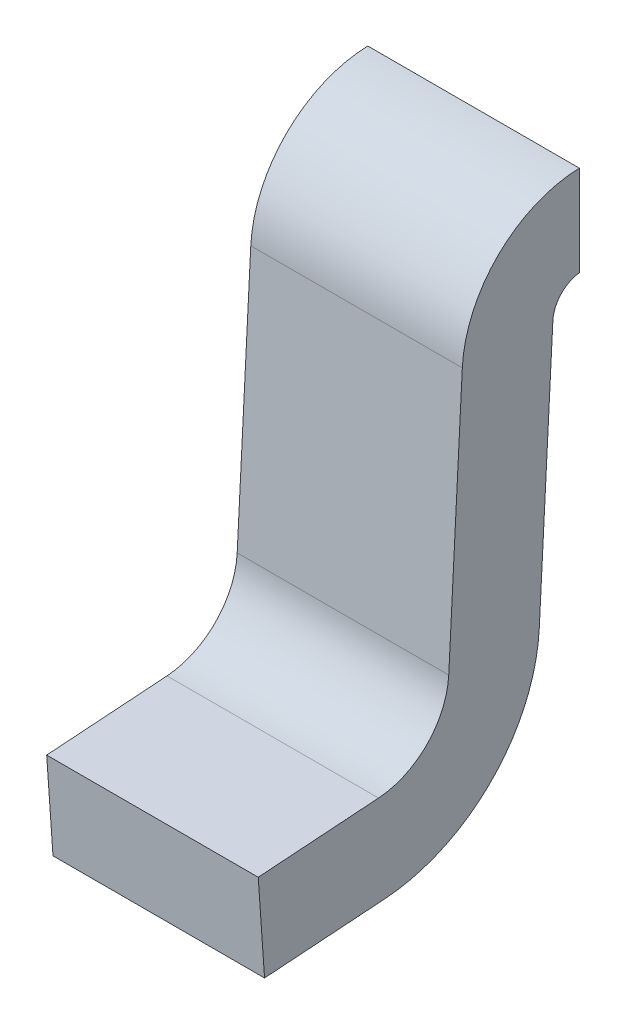
ISO-10303-21;
HEADER;
FILE_DESCRIPTION(('STEP AP214'),'2;1');
FILE_NAME('part.step','',(''),(''),'','','');
FILE_SCHEMA(('AUTOMOTIVE_DESIGN { 1 0 10303 214 1 1 1 1 }'));
ENDSEC;
DATA;
#1=APPLICATION_CONTEXT('core data for automotive mechanical design processes');
#2=APPLICATION_PROTOCOL_DEFINITION('international standard','automotive_design',2000,#1);
#3=PRODUCT_CONTEXT('',#1,'mechanical');
#4=PRODUCT('Part','Part','',(#3));
#5=PRODUCT_RELATED_PRODUCT_CATEGORY('part','',(#4));
#6=PRODUCT_DEFINITION_FORMATION('','',#4);
#7=PRODUCT_DEFINITION_CONTEXT('part definition',#1,'design');
#8=PRODUCT_DEFINITION('design','',#6,#7);
#9=PRODUCT_DEFINITION_SHAPE('','',#8);
#10=(LENGTH_UNIT() NAMED_UNIT(*) SI_UNIT(.MILLI.,.METRE.));
#11=(NAMED_UNIT(*) PLANE_ANGLE_UNIT() SI_UNIT($,.RADIAN.));
#12=(NAMED_UNIT(*) SI_UNIT($,.STERADIAN.) SOLID_ANGLE_UNIT());
#13=UNCERTAINTY_MEASURE_WITH_UNIT(LENGTH_MEASURE(1.E-05),#10,'distance_accuracy_value','');
#14=(GEOMETRIC_REPRESENTATION_CONTEXT(3) GLOBAL_UNCERTAINTY_ASSIGNED_CONTEXT((#13)) GLOBAL_UNIT_ASSIGNED_CONTEXT((#10,
#11,#12)) REPRESENTATION_CONTEXT('',''));
#15=CARTESIAN_POINT('',(0.,0.,0.));
#16=DIRECTION('',(0.,0.,1.));
#17=DIRECTION('',(1.,0.,0.));
#18=AXIS2_PLACEMENT_3D('',#15,#16,#17);
#19=CARTESIAN_POINT('',(0.14,0.,0.));
#20=DIRECTION('',(1.,0.,0.));
#21=DIRECTION('',(0.,0.,-1.));
#22=AXIS2_PLACEMENT_3D('',#19,#20,#21);
#23=PLANE('',#22);
#24=CARTESIAN_POINT('',(0.14,0.410075565103,-0.06154604354519));
#25=DIRECTION('',(-1.,0.,0.));
#26=DIRECTION('',(0.,0.,1.));
#27=AXIS2_PLACEMENT_3D('',#24,#25,#26);
#28=CIRCLE('',#27,0.16);
#29=CARTESIAN_POINT('',(0.14,0.418449318101945,0.0982346820157623));
#30=VERTEX_POINT('',#29);
#31=CARTESIAN_POINT('',(0.14,0.570000000000261,-0.056629223150696));
#32=VERTEX_POINT('',#31);
#33=EDGE_CURVE('E170',#30,#32,#28,.T.);
#34=ORIENTED_EDGE('',*,*,#33,.F.);
#35=DIRECTION('',(0.,-0.998629534754575,0.0523359562429177));
#36=VECTOR('',#35,1.);
#37=CARTESIAN_POINT('',(0.14,0.006280314749153,0.119835544171));
#38=LINE('',#37,#36);
#39=CARTESIAN_POINT('',(0.14,0.0753676436750845,0.116214830684969));
#40=VERTEX_POINT('',#39);
#41=EDGE_CURVE('E84',#40,#30,#38,.F.);
#42=ORIENTED_EDGE('',*,*,#41,.F.);
#43=CARTESIAN_POINT('',(0.14,0.08060123929937,0.21607778416));
#44=DIRECTION('',(1.,0.,0.));
#45=DIRECTION('',(0.,0.,-1.));
#46=AXIS2_PLACEMENT_3D('',#43,#44,#45);
#47=CIRCLE('',#46,0.1);
#48=CARTESIAN_POINT('',(0.14,-0.0191551657266177,0.209102136785794));
#49=VERTEX_POINT('',#48);
#50=EDGE_CURVE('E20',#40,#49,#47,.F.);
#51=ORIENTED_EDGE('',*,*,#50,.T.);
#52=DIRECTION('',(0.,-0.0697564737441177,0.997564050259825));
#53=VECTOR('',#52,1.);
#54=CARTESIAN_POINT('',(0.14,-0.01298363425784,0.120845124958));
#55=LINE('',#54,#53);
#56=CARTESIAN_POINT('',(0.14,-0.0302923139688183,0.368370776849));
#57=VERTEX_POINT('',#56);
#58=EDGE_CURVE('E90',#57,#49,#55,.F.);
#59=ORIENTED_EDGE('',*,*,#58,.F.);
#60=DIRECTION('',(0.,-0.997564050259825,-0.0697564737441177));
#61=VECTOR('',#60,1.);
#62=CARTESIAN_POINT('',(0.14,-0.03029231396882,0.368370776849));
#63=LINE('',#62,#61);
#64=CARTESIAN_POINT('',(0.14,-0.149999999999993,0.359999999999902));
#65=VERTEX_POINT('',#64);
#66=EDGE_CURVE('E96',#65,#57,#63,.F.);
#67=ORIENTED_EDGE('',*,*,#66,.F.);
#68=DIRECTION('',(0.,0.0697564737441177,-0.997564050259825));
#69=VECTOR('',#68,1.);
#70=CARTESIAN_POINT('',(0.14,-0.15,0.36));
#71=LINE('',#70,#69);
#72=CARTESIAN_POINT('',(0.14,-0.138862851757805,0.200731359936653));
#73=VERTEX_POINT('',#72);
#74=EDGE_CURVE('E102',#73,#65,#71,.F.);
#75=ORIENTED_EDGE('',*,*,#74,.F.);
#76=CARTESIAN_POINT('',(0.14,0.08060123929937,0.21607778416));
#77=DIRECTION('',(-1.,0.,0.));
#78=DIRECTION('',(0.,0.,1.));
#79=AXIS2_PLACEMENT_3D('',#76,#77,#78);
#80=CIRCLE('',#79,0.22);
#81=CARTESIAN_POINT('',(0.14,0.0690873289259334,-0.00362071348562642));
#82=VERTEX_POINT('',#81);
#83=EDGE_CURVE('E111',#82,#73,#80,.T.);
#84=ORIENTED_EDGE('',*,*,#83,.F.);
#85=DIRECTION('',(0.,0.998629534754575,-0.0523359562429177));
#86=VECTOR('',#85,1.);
#87=CARTESIAN_POINT('',(0.14,-0.125285482527,0.006565933915618));
#88=LINE('',#87,#86);
#89=CARTESIAN_POINT('',(0.14,0.412398267517858,-0.0216128773807956));
#90=VERTEX_POINT('',#89);
#91=EDGE_CURVE('E149',#90,#82,#88,.F.);
#92=ORIENTED_EDGE('',*,*,#91,.F.);
#93=CARTESIAN_POINT('',(0.14,0.410304829268,-0.06155805877097));
#94=DIRECTION('',(1.,0.,0.));
#95=DIRECTION('',(0.,0.,-1.));
#96=AXIS2_PLACEMENT_3D('',#93,#94,#95);
#97=CIRCLE('',#96,0.04);
#98=CARTESIAN_POINT('',(0.14,0.44999999999991,-0.0566292231507));
#99=VERTEX_POINT('',#98);
#100=EDGE_CURVE('E147',#90,#99,#97,.F.);
#101=ORIENTED_EDGE('',*,*,#100,.T.);
#102=DIRECTION('',(0.,1.,0.));
#103=VECTOR('',#102,1.);
#104=CARTESIAN_POINT('',(0.14,0.45,-0.0566292231507));
#105=LINE('',#104,#103);
#106=EDGE_CURVE('E144',#32,#99,#105,.F.);
#107=ORIENTED_EDGE('',*,*,#106,.F.);
#108=EDGE_LOOP('',(#34,#42,#51,#59,#67,#75,#84,#92,#101,#107));
#109=FACE_BOUND('',#108,.T.);
#110=ADVANCED_FACE('F17',(#109),#23,.T.);
#111=CARTESIAN_POINT('',(-0.14,0.006280314749153,0.119835544171));
#112=DIRECTION('',(0.,0.0523359562429177,0.998629534754575));
#113=DIRECTION('',(0.,-0.998629534754575,0.0523359562429177));
#114=AXIS2_PLACEMENT_3D('',#111,#112,#113);
#115=PLANE('',#114);
#116=DIRECTION('',(-1.,0.,0.));
#117=VECTOR('',#116,1.);
#118=CARTESIAN_POINT('',(0.508824635799,0.418449318102,0.0982346820155351));
#119=LINE('',#118,#117);
#120=CARTESIAN_POINT('',(-0.14,0.418449318101944,0.0982346820155405));
#121=VERTEX_POINT('',#120);
#122=EDGE_CURVE('E172',#121,#30,#119,.F.);
#123=ORIENTED_EDGE('',*,*,#122,.F.);
#124=DIRECTION('',(0.,-0.998629534754568,0.052335956243052));
#125=VECTOR('',#124,1.);
#126=CARTESIAN_POINT('',(-0.14,0.418449318102,0.09823468201554));
#127=LINE('',#126,#125);
#128=CARTESIAN_POINT('',(-0.14,0.0753676436750674,0.116214830684772));
#129=VERTEX_POINT('',#128);
#130=EDGE_CURVE('E169',#121,#129,#127,.T.);
#131=ORIENTED_EDGE('',*,*,#130,.T.);
#132=DIRECTION('',(1.,0.,0.));
#133=VECTOR('',#132,1.);
#134=CARTESIAN_POINT('',(-0.14,0.0753676436750461,0.116214830684544));
#135=LINE('',#134,#133);
#136=EDGE_CURVE('E141',#129,#40,#135,.T.);
#137=ORIENTED_EDGE('',*,*,#136,.T.);
#138=ORIENTED_EDGE('',*,*,#41,.T.);
#139=EDGE_LOOP('',(#123,#131,#137,#138));
#140=FACE_BOUND('',#139,.T.);
#141=ADVANCED_FACE('F292',(#140),#115,.T.);
#142=CARTESIAN_POINT('',(-0.14,0.08060123929937,0.21607778416));
#143=DIRECTION('',(1.,0.,0.));
#144=DIRECTION('',(0.,0.,-1.));
#145=AXIS2_PLACEMENT_3D('',#142,#143,#144);
#146=CYLINDRICAL_SURFACE('',#145,0.1);
#147=ORIENTED_EDGE('',*,*,#136,.F.);
#148=CARTESIAN_POINT('',(-0.14,0.08060123929937,0.21607778416));
#149=DIRECTION('',(1.,0.,0.));
#150=DIRECTION('',(0.,0.,-1.));
#151=AXIS2_PLACEMENT_3D('',#148,#149,#150);
#152=CIRCLE('',#151,0.1);
#153=CARTESIAN_POINT('',(-0.14,-0.0191551657266113,0.209102136785789));
#154=VERTEX_POINT('',#153);
#155=EDGE_CURVE('E129',#129,#154,#152,.F.);
#156=ORIENTED_EDGE('',*,*,#155,.T.);
#157=DIRECTION('',(1.,0.,0.));
#158=VECTOR('',#157,1.);
#159=CARTESIAN_POINT('',(-0.14,-0.019155165726632,0.209102136785999));
#160=LINE('',#159,#158);
#161=EDGE_CURVE('E139',#49,#154,#160,.F.);
#162=ORIENTED_EDGE('',*,*,#161,.F.);
#163=ORIENTED_EDGE('',*,*,#50,.F.);
#164=EDGE_LOOP('',(#147,#156,#162,#163));
#165=FACE_BOUND('',#164,.T.);
#166=ADVANCED_FACE('F284',(#165),#146,.F.);
#167=CARTESIAN_POINT('',(-0.14,-0.01298363425784,0.120845124958));
#168=DIRECTION('',(0.,0.997564050259825,0.0697564737441177));
#169=DIRECTION('',(0.,-0.0697564737441177,0.997564050259825));
#170=AXIS2_PLACEMENT_3D('',#167,#168,#169);
#171=PLANE('',#170);
#172=ORIENTED_EDGE('',*,*,#161,.T.);
#173=DIRECTION('',(0.,-0.0697564737442248,0.997564050259817));
#174=VECTOR('',#173,1.);
#175=CARTESIAN_POINT('',(-0.14,-0.01915516572662,0.209102136786));
#176=LINE('',#175,#174);
#177=CARTESIAN_POINT('',(-0.14,-0.03029231396882,0.368370776849));
#178=VERTEX_POINT('',#177);
#179=EDGE_CURVE('E127',#154,#178,#176,.T.);
#180=ORIENTED_EDGE('',*,*,#179,.T.);
#181=DIRECTION('',(1.,0.,0.));
#182=VECTOR('',#181,1.);
#183=CARTESIAN_POINT('',(-0.14,-0.03029231396882,0.368370776849));
#184=LINE('',#183,#182);
#185=EDGE_CURVE('E126',#57,#178,#184,.F.);
#186=ORIENTED_EDGE('',*,*,#185,.F.);
#187=ORIENTED_EDGE('',*,*,#58,.T.);
#188=EDGE_LOOP('',(#172,#180,#186,#187));
#189=FACE_BOUND('',#188,.T.);
#190=ADVANCED_FACE('F276',(#189),#171,.T.);
#191=CARTESIAN_POINT('',(-0.14,-0.03029231396882,0.368370776849));
#192=DIRECTION('',(0.,-0.0697564737441177,0.997564050259825));
#193=DIRECTION('',(0.,-0.997564050259825,-0.0697564737441177));
#194=AXIS2_PLACEMENT_3D('',#191,#192,#193);
#195=PLANE('',#194);
#196=ORIENTED_EDGE('',*,*,#185,.T.);
#197=DIRECTION('',(0.,-0.997564050259996,-0.0697564737416781));
#198=VECTOR('',#197,1.);
#199=CARTESIAN_POINT('',(-0.14,-0.03029231396882,0.368370776849));
#200=LINE('',#199,#198);
#201=CARTESIAN_POINT('',(-0.14,-0.15,0.36));
#202=VERTEX_POINT('',#201);
#203=EDGE_CURVE('E119',#178,#202,#200,.T.);
#204=ORIENTED_EDGE('',*,*,#203,.T.);
#205=DIRECTION('',(1.,0.,0.));
#206=VECTOR('',#205,1.);
#207=CARTESIAN_POINT('',(-0.14,-0.15,0.36));
#208=LINE('',#207,#206);
#209=EDGE_CURVE('E106',#65,#202,#208,.F.);
#210=ORIENTED_EDGE('',*,*,#209,.F.);
#211=ORIENTED_EDGE('',*,*,#66,.T.);
#212=EDGE_LOOP('',(#196,#204,#210,#211));
#213=FACE_BOUND('',#212,.T.);
#214=ADVANCED_FACE('F125',(#213),#195,.T.);
#215=CARTESIAN_POINT('',(-0.14,-0.15,0.36));
#216=DIRECTION('',(0.,-0.997564050259825,-0.0697564737441177));
#217=DIRECTION('',(0.,0.0697564737441177,-0.997564050259825));
#218=AXIS2_PLACEMENT_3D('',#215,#216,#217);
#219=PLANE('',#218);
#220=ORIENTED_EDGE('',*,*,#209,.T.);
#221=DIRECTION('',(0.,0.0697564737429781,-0.997564050259904));
#222=VECTOR('',#221,1.);
#223=CARTESIAN_POINT('',(-0.14,-0.15,0.36));
#224=LINE('',#223,#222);
#225=CARTESIAN_POINT('',(-0.14,-0.138862851757904,0.200731359936772));
#226=VERTEX_POINT('',#225);
#227=EDGE_CURVE('E109',#202,#226,#224,.T.);
#228=ORIENTED_EDGE('',*,*,#227,.T.);
#229=DIRECTION('',(-1.,0.,0.));
#230=VECTOR('',#229,1.);
#231=CARTESIAN_POINT('',(-0.14,-0.138862851757842,0.200731359937011));
#232=LINE('',#231,#230);
#233=EDGE_CURVE('E152',#73,#226,#232,.T.);
#234=ORIENTED_EDGE('',*,*,#233,.F.);
#235=ORIENTED_EDGE('',*,*,#74,.T.);
#236=EDGE_LOOP('',(#220,#228,#234,#235));
#237=FACE_BOUND('',#236,.T.);
#238=ADVANCED_FACE('F108',(#237),#219,.T.);
#239=CARTESIAN_POINT('',(-0.14,0.08060123929937,0.21607778416));
#240=DIRECTION('',(-1.,0.,0.));
#241=DIRECTION('',(0.,0.,1.));
#242=AXIS2_PLACEMENT_3D('',#239,#240,#241);
#243=CYLINDRICAL_SURFACE('',#242,0.22);
#244=CARTESIAN_POINT('',(-0.14,0.08060123929937,0.21607778416));
#245=DIRECTION('',(-1.,0.,0.));
#246=DIRECTION('',(0.,0.,1.));
#247=AXIS2_PLACEMENT_3D('',#244,#245,#246);
#248=CIRCLE('',#247,0.22);
#249=CARTESIAN_POINT('',(-0.14,0.0690873289259316,-0.00362071348561546));
#250=VERTEX_POINT('',#249);
#251=EDGE_CURVE('E123',#226,#250,#248,.F.);
#252=ORIENTED_EDGE('',*,*,#251,.T.);
#253=DIRECTION('',(1.,0.,0.));
#254=VECTOR('',#253,1.);
#255=CARTESIAN_POINT('',(-0.14,0.0690873289259189,-0.00362071348562566));
#256=LINE('',#255,#254);
#257=EDGE_CURVE('E151',#82,#250,#256,.F.);
#258=ORIENTED_EDGE('',*,*,#257,.F.);
#259=ORIENTED_EDGE('',*,*,#83,.T.);
#260=ORIENTED_EDGE('',*,*,#233,.T.);
#261=EDGE_LOOP('',(#252,#258,#259,#260));
#262=FACE_BOUND('',#261,.T.);
#263=ADVANCED_FACE('F205',(#262),#243,.T.);
#264=CARTESIAN_POINT('',(-0.14,-0.125285482527,0.006565933915618));
#265=DIRECTION('',(0.,-0.0523359562429177,-0.998629534754575));
#266=DIRECTION('',(0.,0.998629534754575,-0.0523359562429177));
#267=AXIS2_PLACEMENT_3D('',#264,#265,#266);
#268=PLANE('',#267);
#269=ORIENTED_EDGE('',*,*,#257,.T.);
#270=DIRECTION('',(0.,0.998629534754574,-0.0523359562429396));
#271=VECTOR('',#270,1.);
#272=CARTESIAN_POINT('',(-0.14,0.06908732892592,-0.003620713485604));
#273=LINE('',#272,#271);
#274=CARTESIAN_POINT('',(-0.14,0.412398267517859,-0.0216128773807885));
#275=VERTEX_POINT('',#274);
#276=EDGE_CURVE('E165',#250,#275,#273,.T.);
#277=ORIENTED_EDGE('',*,*,#276,.T.);
#278=DIRECTION('',(1.,0.,0.));
#279=VECTOR('',#278,1.);
#280=CARTESIAN_POINT('',(-0.508824635799,0.412398267517999,-0.0216128773808018));
#281=LINE('',#280,#279);
#282=EDGE_CURVE('E174',#275,#90,#281,.T.);
#283=ORIENTED_EDGE('',*,*,#282,.T.);
#284=ORIENTED_EDGE('',*,*,#91,.T.);
#285=EDGE_LOOP('',(#269,#277,#283,#284));
#286=FACE_BOUND('',#285,.T.);
#287=ADVANCED_FACE('F204',(#286),#268,.T.);
#288=CARTESIAN_POINT('',(-0.508824635799,0.410304829268,-0.06155805877097));
#289=DIRECTION('',(1.,0.,0.));
#290=DIRECTION('',(0.,0.,-1.));
#291=AXIS2_PLACEMENT_3D('',#288,#289,#290);
#292=CYLINDRICAL_SURFACE('',#291,0.04);
#293=ORIENTED_EDGE('',*,*,#282,.F.);
#294=CARTESIAN_POINT('',(-0.14,0.410304829268,-0.06155805877097));
#295=DIRECTION('',(1.,0.,0.));
#296=DIRECTION('',(0.,0.,-1.));
#297=AXIS2_PLACEMENT_3D('',#294,#295,#296);
#298=CIRCLE('',#297,0.04);
#299=CARTESIAN_POINT('',(-0.14,0.44999999999991,-0.0566292231507));
#300=VERTEX_POINT('',#299);
#301=EDGE_CURVE('E162',#275,#300,#298,.F.);
#302=ORIENTED_EDGE('',*,*,#301,.T.);
#303=DIRECTION('',(-1.,0.,0.));
#304=VECTOR('',#303,1.);
#305=CARTESIAN_POINT('',(-0.14,0.45,-0.0566292231507));
#306=LINE('',#305,#304);
#307=EDGE_CURVE('E146',#99,#300,#306,.T.);
#308=ORIENTED_EDGE('',*,*,#307,.F.);
#309=ORIENTED_EDGE('',*,*,#100,.F.);
#310=EDGE_LOOP('',(#293,#302,#308,#309));
#311=FACE_BOUND('',#310,.T.);
#312=ADVANCED_FACE('F201',(#311),#292,.F.);
#313=CARTESIAN_POINT('',(-0.14,0.45,-0.0566292231507));
#314=DIRECTION('',(0.,0.,-1.));
#315=DIRECTION('',(-1.,0.,0.));
#316=AXIS2_PLACEMENT_3D('',#313,#314,#315);
#317=PLANE('',#316);
#318=DIRECTION('',(0.,1.,0.));
#319=VECTOR('',#318,1.);
#320=CARTESIAN_POINT('',(-0.14,0.,-0.0566292231507));
#321=LINE('',#320,#319);
#322=CARTESIAN_POINT('',(-0.14,0.570000000000261,-0.056629223150696));
#323=VERTEX_POINT('',#322);
#324=EDGE_CURVE('E26',#300,#323,#321,.T.);
#325=ORIENTED_EDGE('',*,*,#324,.T.);
#326=DIRECTION('',(-1.,0.,0.));
#327=VECTOR('',#326,1.);
#328=CARTESIAN_POINT('',(0.508824635799,0.570000000000261,-0.056629223150692));
#329=LINE('',#328,#327);
#330=EDGE_CURVE('E34',#32,#323,#329,.T.);
#331=ORIENTED_EDGE('',*,*,#330,.F.);
#332=ORIENTED_EDGE('',*,*,#106,.T.);
#333=ORIENTED_EDGE('',*,*,#307,.T.);
#334=EDGE_LOOP('',(#325,#331,#332,#333));
#335=FACE_BOUND('',#334,.T.);
#336=ADVANCED_FACE('F197',(#335),#317,.T.);
#337=CARTESIAN_POINT('',(0.508824635799,0.410075565103,-0.06154604354519));
#338=DIRECTION('',(-1.,0.,0.));
#339=DIRECTION('',(0.,0.,1.));
#340=AXIS2_PLACEMENT_3D('',#337,#338,#339);
#341=CYLINDRICAL_SURFACE('',#340,0.16);
#342=ORIENTED_EDGE('',*,*,#330,.T.);
#343=CARTESIAN_POINT('',(-0.14,0.410075565103,-0.06154604354519));
#344=DIRECTION('',(-1.,0.,0.));
#345=DIRECTION('',(0.,0.,1.));
#346=AXIS2_PLACEMENT_3D('',#343,#344,#345);
#347=CIRCLE('',#346,0.16);
#348=EDGE_CURVE('E11',#323,#121,#347,.F.);
#349=ORIENTED_EDGE('',*,*,#348,.T.);
#350=ORIENTED_EDGE('',*,*,#122,.T.);
#351=ORIENTED_EDGE('',*,*,#33,.T.);
#352=EDGE_LOOP('',(#342,#349,#350,#351));
#353=FACE_BOUND('',#352,.T.);
#354=ADVANCED_FACE('F216',(#353),#341,.T.);
#355=CARTESIAN_POINT('',(-0.14,0.,0.));
#356=DIRECTION('',(1.,0.,0.));
#357=DIRECTION('',(0.,0.,-1.));
#358=AXIS2_PLACEMENT_3D('',#355,#356,#357);
#359=PLANE('',#358);
#360=ORIENTED_EDGE('',*,*,#324,.F.);
#361=ORIENTED_EDGE('',*,*,#301,.F.);
#362=ORIENTED_EDGE('',*,*,#276,.F.);
#363=ORIENTED_EDGE('',*,*,#251,.F.);
#364=ORIENTED_EDGE('',*,*,#227,.F.);
#365=ORIENTED_EDGE('',*,*,#203,.F.);
#366=ORIENTED_EDGE('',*,*,#179,.F.);
#367=ORIENTED_EDGE('',*,*,#155,.F.);
#368=ORIENTED_EDGE('',*,*,#130,.F.);
#369=ORIENTED_EDGE('',*,*,#348,.F.);
#370=EDGE_LOOP('',(#360,#361,#362,#363,#364,#365,#366,#367,#368,#369));
#371=FACE_BOUND('',#370,.T.);
#372=ADVANCED_FACE('F117',(#371),#359,.F.);
#373=CLOSED_SHELL('',(#110,#141,#166,#190,#214,#238,#263,#287,#312,#336,#354,#372));
#374=MANIFOLD_SOLID_BREP('B1',#373);
#375=ADVANCED_BREP_SHAPE_REPRESENTATION('',(#18,#374),#14);
#376=SHAPE_DEFINITION_REPRESENTATION(#9,#375);
ENDSEC;
END-ISO-10303-21;
